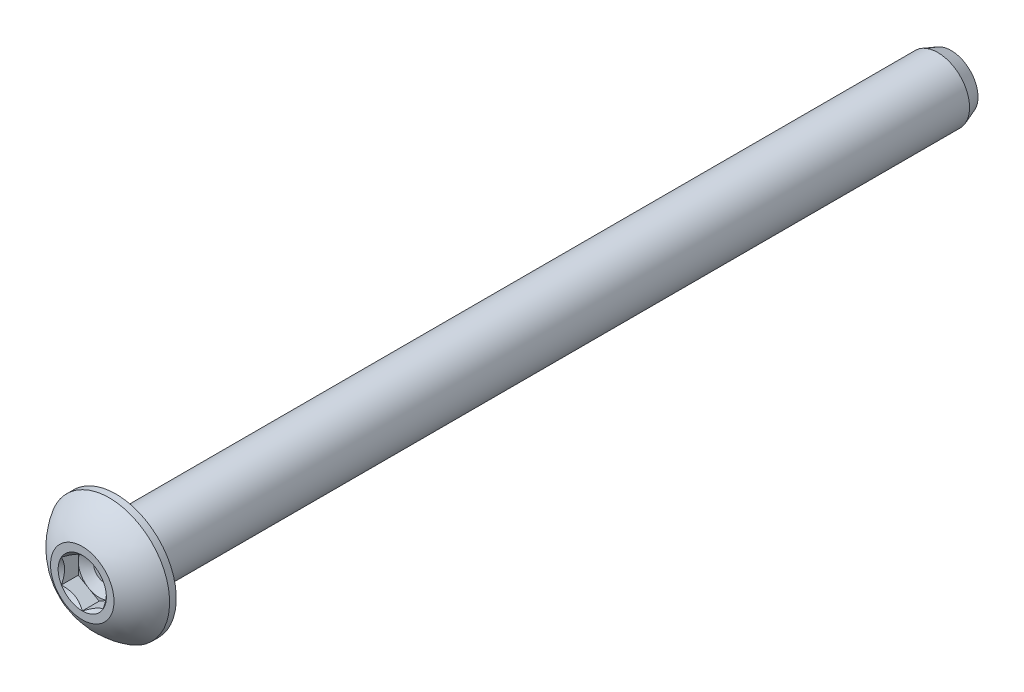
ISO-10303-21;
HEADER;
FILE_DESCRIPTION(('STEP AP214'),'2;1');
FILE_NAME('part.step','',(''),(''),'','','');
FILE_SCHEMA(('AUTOMOTIVE_DESIGN { 1 0 10303 214 1 1 1 1 }'));
ENDSEC;
DATA;
#1=APPLICATION_CONTEXT('core data for automotive mechanical design processes');
#2=APPLICATION_PROTOCOL_DEFINITION('international standard','automotive_design',2000,#1);
#3=PRODUCT_CONTEXT('',#1,'mechanical');
#4=PRODUCT('Part','Part','',(#3));
#5=PRODUCT_RELATED_PRODUCT_CATEGORY('part','',(#4));
#6=PRODUCT_DEFINITION_FORMATION('','',#4);
#7=PRODUCT_DEFINITION_CONTEXT('part definition',#1,'design');
#8=PRODUCT_DEFINITION('design','',#6,#7);
#9=PRODUCT_DEFINITION_SHAPE('','',#8);
#10=(LENGTH_UNIT() NAMED_UNIT(*) SI_UNIT(.MILLI.,.METRE.));
#11=(NAMED_UNIT(*) PLANE_ANGLE_UNIT() SI_UNIT($,.RADIAN.));
#12=(NAMED_UNIT(*) SI_UNIT($,.STERADIAN.) SOLID_ANGLE_UNIT());
#13=UNCERTAINTY_MEASURE_WITH_UNIT(LENGTH_MEASURE(1.E-05),#10,'distance_accuracy_value','');
#14=(GEOMETRIC_REPRESENTATION_CONTEXT(3) GLOBAL_UNCERTAINTY_ASSIGNED_CONTEXT((#13)) GLOBAL_UNIT_ASSIGNED_CONTEXT((#10,
#11,#12)) REPRESENTATION_CONTEXT('',''));
#15=CARTESIAN_POINT('',(0.,0.,0.));
#16=DIRECTION('',(0.,0.,1.));
#17=DIRECTION('',(1.,0.,0.));
#18=AXIS2_PLACEMENT_3D('',#15,#16,#17);
#19=CARTESIAN_POINT('',(0.,0.,0.855133333333334));
#20=DIRECTION('',(0.,0.,1.));
#21=DIRECTION('',(1.,0.,0.));
#22=AXIS2_PLACEMENT_3D('',#19,#20,#21);
#23=PLANE('',#22);
#24=CARTESIAN_POINT('',(0.,0.,0.855133333330517));
#25=DIRECTION('',(0.,0.,1.));
#26=DIRECTION('',(1.,0.,0.));
#27=AXIS2_PLACEMENT_3D('',#24,#25,#26);
#28=CIRCLE('',#27,0.846932809736245);
#29=CARTESIAN_POINT('',(0.846932809736245,0.,0.855133333330517));
#30=VERTEX_POINT('',#29);
#31=EDGE_CURVE('E21',#30,#30,#28,.T.);
#32=ORIENTED_EDGE('',*,*,#31,.T.);
#33=EDGE_LOOP('',(#32));
#34=FACE_BOUND('',#33,.T.);
#35=ADVANCED_FACE('F18',(#34),#23,.T.);
#36=CARTESIAN_POINT('',(0.,0.,1.28269999987651));
#37=DIRECTION('',(0.,0.,1.));
#38=DIRECTION('',(1.,0.,0.));
#39=AXIS2_PLACEMENT_3D('',#36,#37,#38);
#40=CONICAL_SURFACE('',#39,1.58749999980046,1.04719755118706);
#41=ORIENTED_EDGE('',*,*,#31,.F.);
#42=EDGE_LOOP('',(#41));
#43=FACE_BOUND('',#42,.T.);
#44=CARTESIAN_POINT('',(0.,0.,1.28270000000779));
#45=DIRECTION('',(0.,0.,1.));
#46=DIRECTION('',(1.,0.,0.));
#47=AXIS2_PLACEMENT_3D('',#44,#45,#46);
#48=CIRCLE('',#47,1.58750000002783);
#49=CARTESIAN_POINT('',(0.793750000006951,-1.37481532851988,1.28270000000389));
#50=VERTEX_POINT('',#49);
#51=CARTESIAN_POINT('',(1.58750000001387,0.,1.28270000000389));
#52=VERTEX_POINT('',#51);
#53=EDGE_CURVE('E77',#50,#52,#48,.T.);
#54=ORIENTED_EDGE('',*,*,#53,.T.);
#55=CARTESIAN_POINT('',(0.,0.,1.28270000000779));
#56=DIRECTION('',(0.,0.,1.));
#57=DIRECTION('',(1.,0.,0.));
#58=AXIS2_PLACEMENT_3D('',#55,#56,#57);
#59=CIRCLE('',#58,1.58750000002783);
#60=CARTESIAN_POINT('',(0.793750000006925,1.37481532851983,1.28270000000389));
#61=VERTEX_POINT('',#60);
#62=EDGE_CURVE('E81',#52,#61,#59,.T.);
#63=ORIENTED_EDGE('',*,*,#62,.T.);
#64=CARTESIAN_POINT('',(0.,0.,1.28270000000779));
#65=DIRECTION('',(0.,0.,1.));
#66=DIRECTION('',(1.,0.,0.));
#67=AXIS2_PLACEMENT_3D('',#64,#65,#66);
#68=CIRCLE('',#67,1.58750000002783);
#69=CARTESIAN_POINT('',(-0.793750000007028,1.37481532851979,1.28270000000389));
#70=VERTEX_POINT('',#69);
#71=EDGE_CURVE('E85',#61,#70,#68,.T.);
#72=ORIENTED_EDGE('',*,*,#71,.T.);
#73=CARTESIAN_POINT('',(0.,0.,1.28270000000779));
#74=DIRECTION('',(0.,0.,1.));
#75=DIRECTION('',(1.,0.,0.));
#76=AXIS2_PLACEMENT_3D('',#73,#74,#75);
#77=CIRCLE('',#76,1.58750000002783);
#78=CARTESIAN_POINT('',(-1.58750000001387,0.,1.28270000000389));
#79=VERTEX_POINT('',#78);
#80=EDGE_CURVE('E98',#70,#79,#77,.T.);
#81=ORIENTED_EDGE('',*,*,#80,.T.);
#82=CARTESIAN_POINT('',(0.,0.,1.28270000000779));
#83=DIRECTION('',(0.,0.,1.));
#84=DIRECTION('',(1.,0.,0.));
#85=AXIS2_PLACEMENT_3D('',#82,#83,#84);
#86=CIRCLE('',#85,1.58750000002783);
#87=CARTESIAN_POINT('',(-0.793750000006951,-1.37481532851986,1.28270000000389));
#88=VERTEX_POINT('',#87);
#89=EDGE_CURVE('E107',#79,#88,#86,.T.);
#90=ORIENTED_EDGE('',*,*,#89,.T.);
#91=CARTESIAN_POINT('',(0.,0.,1.28270000000779));
#92=DIRECTION('',(0.,0.,1.));
#93=DIRECTION('',(1.,0.,0.));
#94=AXIS2_PLACEMENT_3D('',#91,#92,#93);
#95=CIRCLE('',#94,1.58750000002783);
#96=EDGE_CURVE('E408',#88,#50,#95,.T.);
#97=ORIENTED_EDGE('',*,*,#96,.T.);
#98=EDGE_LOOP('',(#54,#63,#72,#81,#90,#97));
#99=FACE_BOUND('',#98,.T.);
#100=ADVANCED_FACE('F83',(#43,#99),#40,.F.);
#101=CARTESIAN_POINT('',(-1.58750000000002,-0.916543552338542,1.2827));
#102=DIRECTION('',(0.,0.,-1.));
#103=DIRECTION('',(-1.,0.,0.));
#104=AXIS2_PLACEMENT_3D('',#101,#102,#103);
#105=PLANE('',#104);
#106=DIRECTION('',(0.,1.,0.));
#107=VECTOR('',#106,1.);
#108=CARTESIAN_POINT('',(1.58749999999991,-0.916543552338528,1.2827));
#109=LINE('',#108,#107);
#110=CARTESIAN_POINT('',(1.58749999999991,0.916543552338514,1.2827));
#111=VERTEX_POINT('',#110);
#112=EDGE_CURVE('E92',#52,#111,#109,.T.);
#113=ORIENTED_EDGE('',*,*,#112,.T.);
#114=DIRECTION('',(-0.866025403784439,0.5,0.));
#115=VECTOR('',#114,1.);
#116=CARTESIAN_POINT('',(1.58749999999991,0.916543552338514,1.2827));
#117=LINE('',#116,#115);
#118=EDGE_CURVE('E90',#111,#61,#117,.T.);
#119=ORIENTED_EDGE('',*,*,#118,.T.);
#120=ORIENTED_EDGE('',*,*,#62,.F.);
#121=EDGE_LOOP('',(#113,#119,#120));
#122=FACE_BOUND('',#121,.T.);
#123=ADVANCED_FACE('F91',(#122),#105,.F.);
#124=CARTESIAN_POINT('',(-1.58750000000002,-0.916543552338542,1.2827));
#125=DIRECTION('',(0.,0.,-1.));
#126=DIRECTION('',(-1.,0.,0.));
#127=AXIS2_PLACEMENT_3D('',#124,#125,#126);
#128=PLANE('',#127);
#129=DIRECTION('',(0.866025403784439,0.5,0.));
#130=VECTOR('',#129,1.);
#131=CARTESIAN_POINT('',(0.,-1.83308710467708,1.2827));
#132=LINE('',#131,#130);
#133=CARTESIAN_POINT('',(1.58749999999994,-0.91654355233861,1.2827));
#134=VERTEX_POINT('',#133);
#135=EDGE_CURVE('E151',#50,#134,#132,.T.);
#136=ORIENTED_EDGE('',*,*,#135,.T.);
#137=DIRECTION('',(0.,1.,0.));
#138=VECTOR('',#137,1.);
#139=CARTESIAN_POINT('',(1.58749999999991,-0.916543552338528,1.2827));
#140=LINE('',#139,#138);
#141=EDGE_CURVE('E112',#134,#52,#140,.T.);
#142=ORIENTED_EDGE('',*,*,#141,.T.);
#143=ORIENTED_EDGE('',*,*,#53,.F.);
#144=EDGE_LOOP('',(#136,#142,#143));
#145=FACE_BOUND('',#144,.T.);
#146=ADVANCED_FACE('F296',(#145),#128,.F.);
#147=CARTESIAN_POINT('',(-1.58750000000002,-0.916543552338542,1.2827));
#148=DIRECTION('',(0.,0.,-1.));
#149=DIRECTION('',(-1.,0.,0.));
#150=AXIS2_PLACEMENT_3D('',#147,#148,#149);
#151=PLANE('',#150);
#152=DIRECTION('',(0.866025403784439,-0.5,0.));
#153=VECTOR('',#152,1.);
#154=CARTESIAN_POINT('',(-1.58750000000002,-0.916543552338542,1.2827));
#155=LINE('',#154,#153);
#156=CARTESIAN_POINT('',(0.,-1.8330871046771,1.2827));
#157=VERTEX_POINT('',#156);
#158=EDGE_CURVE('E140',#88,#157,#155,.T.);
#159=ORIENTED_EDGE('',*,*,#158,.T.);
#160=DIRECTION('',(0.866025403784439,0.5,0.));
#161=VECTOR('',#160,1.);
#162=CARTESIAN_POINT('',(0.,-1.83308710467708,1.2827));
#163=LINE('',#162,#161);
#164=EDGE_CURVE('E148',#157,#50,#163,.T.);
#165=ORIENTED_EDGE('',*,*,#164,.T.);
#166=ORIENTED_EDGE('',*,*,#96,.F.);
#167=EDGE_LOOP('',(#159,#165,#166));
#168=FACE_BOUND('',#167,.T.);
#169=ADVANCED_FACE('F292',(#168),#151,.F.);
#170=CARTESIAN_POINT('',(-1.58750000000002,-0.916543552338542,1.2827));
#171=DIRECTION('',(0.,0.,-1.));
#172=DIRECTION('',(-1.,0.,0.));
#173=AXIS2_PLACEMENT_3D('',#170,#171,#172);
#174=PLANE('',#173);
#175=DIRECTION('',(0.,-1.,0.));
#176=VECTOR('',#175,1.);
#177=CARTESIAN_POINT('',(-1.58749999999991,0.9165435523385,1.2827));
#178=LINE('',#177,#176);
#179=CARTESIAN_POINT('',(-1.58749999999992,-0.916543552338558,1.2827));
#180=VERTEX_POINT('',#179);
#181=EDGE_CURVE('E129',#79,#180,#178,.T.);
#182=ORIENTED_EDGE('',*,*,#181,.T.);
#183=DIRECTION('',(0.866025403784439,-0.5,0.));
#184=VECTOR('',#183,1.);
#185=CARTESIAN_POINT('',(-1.58750000000002,-0.916543552338542,1.2827));
#186=LINE('',#185,#184);
#187=EDGE_CURVE('E137',#180,#88,#186,.T.);
#188=ORIENTED_EDGE('',*,*,#187,.T.);
#189=ORIENTED_EDGE('',*,*,#89,.F.);
#190=EDGE_LOOP('',(#182,#188,#189));
#191=FACE_BOUND('',#190,.T.);
#192=ADVANCED_FACE('F289',(#191),#174,.F.);
#193=CARTESIAN_POINT('',(-1.58750000000002,-0.916543552338542,1.2827));
#194=DIRECTION('',(0.,0.,-1.));
#195=DIRECTION('',(-1.,0.,0.));
#196=AXIS2_PLACEMENT_3D('',#193,#194,#195);
#197=PLANE('',#196);
#198=DIRECTION('',(-0.866025403784439,0.5,0.));
#199=VECTOR('',#198,1.);
#200=CARTESIAN_POINT('',(1.58749999999991,0.916543552338514,1.2827));
#201=LINE('',#200,#199);
#202=CARTESIAN_POINT('',(0.,1.83308710467702,1.2827));
#203=VERTEX_POINT('',#202);
#204=EDGE_CURVE('E97',#61,#203,#201,.T.);
#205=ORIENTED_EDGE('',*,*,#204,.T.);
#206=DIRECTION('',(-0.866025403784439,-0.5,0.));
#207=VECTOR('',#206,1.);
#208=CARTESIAN_POINT('',(0.,1.83308710467703,1.2827));
#209=LINE('',#208,#207);
#210=EDGE_CURVE('E105',#203,#70,#209,.T.);
#211=ORIENTED_EDGE('',*,*,#210,.T.);
#212=ORIENTED_EDGE('',*,*,#71,.F.);
#213=EDGE_LOOP('',(#205,#211,#212));
#214=FACE_BOUND('',#213,.T.);
#215=ADVANCED_FACE('F102',(#214),#197,.F.);
#216=CARTESIAN_POINT('',(-1.58750000000002,-0.916543552338542,1.2827));
#217=DIRECTION('',(0.,0.,-1.));
#218=DIRECTION('',(-1.,0.,0.));
#219=AXIS2_PLACEMENT_3D('',#216,#217,#218);
#220=PLANE('',#219);
#221=DIRECTION('',(-0.866025403784439,-0.5,0.));
#222=VECTOR('',#221,1.);
#223=CARTESIAN_POINT('',(0.,1.83308710467703,1.2827));
#224=LINE('',#223,#222);
#225=CARTESIAN_POINT('',(-1.58749999999992,0.916543552338538,1.2827));
#226=VERTEX_POINT('',#225);
#227=EDGE_CURVE('E122',#70,#226,#224,.T.);
#228=ORIENTED_EDGE('',*,*,#227,.T.);
#229=DIRECTION('',(0.,-1.,0.));
#230=VECTOR('',#229,1.);
#231=CARTESIAN_POINT('',(-1.58749999999991,0.9165435523385,1.2827));
#232=LINE('',#231,#230);
#233=EDGE_CURVE('E126',#226,#79,#232,.T.);
#234=ORIENTED_EDGE('',*,*,#233,.T.);
#235=ORIENTED_EDGE('',*,*,#80,.F.);
#236=EDGE_LOOP('',(#228,#234,#235));
#237=FACE_BOUND('',#236,.T.);
#238=ADVANCED_FACE('F283',(#237),#220,.F.);
#239=CARTESIAN_POINT('',(1.58749999999991,0.916543552338514,1.2827));
#240=DIRECTION('',(0.5,0.866025403784439,0.));
#241=DIRECTION('',(-0.866025403784439,0.5,0.));
#242=AXIS2_PLACEMENT_3D('',#239,#240,#241);
#243=PLANE('',#242);
#244=CARTESIAN_POINT('',(1.58750000001185,0.91654355233162,2.56539999993598));
#245=CARTESIAN_POINT('',(1.53293684974874,0.948045601823858,2.53392818229203));
#246=CARTESIAN_POINT('',(1.4774614024377,0.980074366262304,2.50430506271237));
#247=CARTESIAN_POINT('',(1.36434127235532,1.04538430381613,2.45006639538277));
#248=CARTESIAN_POINT('',(1.30668583773197,1.07867168451617,2.42548101614827));
#249=CARTESIAN_POINT('',(1.19042648197841,1.1457940548563,2.3833660960344));
#250=CARTESIAN_POINT('',(1.13185215264058,1.1796119596671,2.36573072946296));
#251=CARTESIAN_POINT('',(1.01341433790047,1.24799206388953,2.3385600885892));
#252=CARTESIAN_POINT('',(0.953554468003095,1.28255217588843,2.3290045400331));
#253=CARTESIAN_POINT('',(0.850383225974686,1.34211812024616,2.32038274178906));
#254=CARTESIAN_POINT('',(0.807205047813984,1.36704705303036,2.31910682167378));
#255=CARTESIAN_POINT('',(0.720919334279943,1.41686413296646,2.32125913774122));
#256=CARTESIAN_POINT('',(0.677811828968887,1.44175226276189,2.32468902277264));
#257=CARTESIAN_POINT('',(0.592014800120523,1.49128720046317,2.33605631407201));
#258=CARTESIAN_POINT('',(0.549325670754726,1.51593378079398,2.34399762009834));
#259=CARTESIAN_POINT('',(0.46466394932955,1.56481324844886,2.36395627670772));
#260=CARTESIAN_POINT('',(0.422691672838002,1.58904595357976,2.37597537616383));
#261=CARTESIAN_POINT('',(0.315224720564427,1.65109202740389,2.41164383175777));
#262=CARTESIAN_POINT('',(0.250395444006949,1.68852122767572,2.43797770742184));
#263=CARTESIAN_POINT('',(0.155071115738203,1.743556754262,2.4824306144577));
#264=CARTESIAN_POINT('',(0.123658790094601,1.76169266892821,2.49804835918406));
#265=CARTESIAN_POINT('',(0.0614115175812596,1.79763114847011,2.53070945048178));
#266=CARTESIAN_POINT('',(0.0305763044283722,1.81543386708445,2.54775211869481));
#267=CARTESIAN_POINT('',(-1.19450151287092E-11,1.83308710468389,2.565399999936));
#268=B_SPLINE_CURVE_WITH_KNOTS('',3,(#244,#245,#246,#247,#248,#249,#250,#251,#252,#253,#254,
#255,#256,#257,#258,#259,#260,#261,#262,#263,#264,#265,#266,#267),.UNSPECIFIED.,.F.,.F.,(4,2,2,
2,2,2,2,2,2,2,2,4),(0.,0.21142792770008,0.42408719708428,0.633370156328154,0.842126401391114,
0.991537200929581,1.1410003653069,1.29059292551435,1.4402497238465,1.6778172140346,
1.79627069405981,1.9146680999862),.UNSPECIFIED.);
#269=CARTESIAN_POINT('',(1.58750000000588,0.916543552341969,2.56539999993598));
#270=VERTEX_POINT('',#269);
#271=CARTESIAN_POINT('',(1.1273531229641E-12,1.83308710467768,2.56539999992979));
#272=VERTEX_POINT('',#271);
#273=EDGE_CURVE('E270',#270,#272,#268,.T.);
#274=ORIENTED_EDGE('',*,*,#273,.T.);
#275=DIRECTION('',(0.,0.,1.));
#276=VECTOR('',#275,1.);
#277=CARTESIAN_POINT('',(0.,1.83308710467703,1.2827));
#278=LINE('',#277,#276);
#279=EDGE_CURVE('E111',#272,#203,#278,.F.);
#280=ORIENTED_EDGE('',*,*,#279,.T.);
#281=ORIENTED_EDGE('',*,*,#204,.F.);
#282=ORIENTED_EDGE('',*,*,#118,.F.);
#283=DIRECTION('',(0.,0.,1.));
#284=VECTOR('',#283,1.);
#285=CARTESIAN_POINT('',(1.58749999999991,0.916543552338514,1.2827));
#286=LINE('',#285,#284);
#287=EDGE_CURVE('E152',#111,#270,#286,.T.);
#288=ORIENTED_EDGE('',*,*,#287,.T.);
#289=EDGE_LOOP('',(#274,#280,#281,#282,#288));
#290=FACE_BOUND('',#289,.T.);
#291=ADVANCED_FACE('F109',(#290),#243,.F.);
#292=CARTESIAN_POINT('',(1.58749999999991,-0.916543552338528,1.2827));
#293=DIRECTION('',(1.,0.,0.));
#294=DIRECTION('',(0.,1.,0.));
#295=AXIS2_PLACEMENT_3D('',#292,#293,#294);
#296=PLANE('',#295);
#297=CARTESIAN_POINT('',(1.58749999999991,-0.916543552352334,2.56539999993599));
#298=CARTESIAN_POINT('',(1.58749999999991,-0.853951042751045,2.53413294687157));
#299=CARTESIAN_POINT('',(1.58749999999991,-0.790318655183798,2.50469158144839));
#300=CARTESIAN_POINT('',(1.58749999999991,-0.660541633658649,2.45072496397082));
#301=CARTESIAN_POINT('',(1.58749999999991,-0.594383506069397,2.42623244845365));
#302=CARTESIAN_POINT('',(1.58749999999991,-0.460155167710919,2.38393913822341));
#303=CARTESIAN_POINT('',(1.58749999999991,-0.39209228736965,2.36611569660129));
#304=CARTESIAN_POINT('',(1.58749999999991,-0.254474472998901,2.33867573772197));
#305=CARTESIAN_POINT('',(1.58749999999991,-0.184924844085367,2.3290338417733));
#306=CARTESIAN_POINT('',(1.58749999999991,-0.0959348173029596,2.32259288204429));
#307=CARTESIAN_POINT('',(1.58749999999991,-0.0767574755190686,2.32155158039191));
#308=CARTESIAN_POINT('',(1.58749999999991,-0.0383876515906479,2.32016146096761));
#309=CARTESIAN_POINT('',(1.58749999999991,-0.0191951833459973,2.31981226701814));
#310=CARTESIAN_POINT('',(1.58749999999991,0.0481761373886669,2.31981447199555));
#311=CARTESIAN_POINT('',(1.58749999999991,0.0963693775084981,2.32201961832725));
#312=CARTESIAN_POINT('',(1.58749999999991,0.192379976759667,2.33070924092623));
#313=CARTESIAN_POINT('',(1.58749999999991,0.240197050167158,2.3371967019236));
#314=CARTESIAN_POINT('',(1.58749999999991,0.383011002180353,2.3626769834978));
#315=CARTESIAN_POINT('',(1.58749999999991,0.476967063071624,2.38768338081251));
#316=CARTESIAN_POINT('',(1.58749999999991,0.62873718987545,2.43884002865904));
#317=CARTESIAN_POINT('',(1.58749999999991,0.687787687831556,2.46158766207784));
#318=CARTESIAN_POINT('',(1.58749999999991,0.803652764121719,2.51088912315494));
#319=CARTESIAN_POINT('',(1.58749999999991,0.860482853238123,2.53740623436211));
#320=CARTESIAN_POINT('',(1.58749999999991,0.916543552352318,2.56539999993598));
#321=B_SPLINE_CURVE_WITH_KNOTS('',3,(#297,#298,#299,#300,#301,#302,#303,#304,#305,#306,#307,
#308,#309,#310,#311,#312,#313,#314,#315,#316,#317,#318,#319,#320),.UNSPECIFIED.,.F.,.F.,(4,2,2,
2,2,2,2,2,2,2,2,4),(0.,0.210047204138947,0.421441388616464,0.632111059444868,0.842124830789351,
0.899732953408524,0.957309756000625,1.10181621379675,1.24642349763582,1.53683268063598,
1.72655304070381,1.91453812064542),.UNSPECIFIED.);
#322=CARTESIAN_POINT('',(1.58750000000589,-0.916543552342033,2.56539999993602));
#323=VERTEX_POINT('',#322);
#324=EDGE_CURVE('E265',#323,#270,#321,.T.);
#325=ORIENTED_EDGE('',*,*,#324,.T.);
#326=ORIENTED_EDGE('',*,*,#287,.F.);
#327=ORIENTED_EDGE('',*,*,#112,.F.);
#328=ORIENTED_EDGE('',*,*,#141,.F.);
#329=DIRECTION('',(0.,0.,1.));
#330=VECTOR('',#329,1.);
#331=CARTESIAN_POINT('',(1.58749999999996,-0.91654355233861,1.2827));
#332=LINE('',#331,#330);
#333=EDGE_CURVE('E141',#134,#323,#332,.T.);
#334=ORIENTED_EDGE('',*,*,#333,.T.);
#335=EDGE_LOOP('',(#325,#326,#327,#328,#334));
#336=FACE_BOUND('',#335,.T.);
#337=ADVANCED_FACE('F276',(#336),#296,.F.);
#338=CARTESIAN_POINT('',(0.,-1.83308710467708,1.2827));
#339=DIRECTION('',(0.5,-0.866025403784439,0.));
#340=DIRECTION('',(0.866025403784439,0.5,0.));
#341=AXIS2_PLACEMENT_3D('',#338,#339,#340);
#342=PLANE('',#341);
#343=CARTESIAN_POINT('',(-1.18407458458331E-11,-1.83308710468395,2.56539999993606));
#344=CARTESIAN_POINT('',(0.0545631502512638,-1.80158505519171,2.53392818229212));
#345=CARTESIAN_POINT('',(0.110038597562308,-1.76955629075327,2.50430506271246));
#346=CARTESIAN_POINT('',(0.223158727644685,-1.70424635319944,2.45006639538286));
#347=CARTESIAN_POINT('',(0.280814162268038,-1.6709589724994,2.42548101614836));
#348=CARTESIAN_POINT('',(0.397073518021597,-1.60383660215928,2.3833660960345));
#349=CARTESIAN_POINT('',(0.455647847359426,-1.57001869734848,2.36573072946306));
#350=CARTESIAN_POINT('',(0.574085662099533,-1.50163859312605,2.3385600885893));
#351=CARTESIAN_POINT('',(0.633945531996905,-1.46707848112714,2.32900454003321));
#352=CARTESIAN_POINT('',(0.737116774025315,-1.40751253676941,2.32038274178917));
#353=CARTESIAN_POINT('',(0.78029495218602,-1.38258360398521,2.31910682167389));
#354=CARTESIAN_POINT('',(0.866580665720066,-1.33276652404911,2.32125913774133));
#355=CARTESIAN_POINT('',(0.909688171031124,-1.30787839425368,2.32468902277275));
#356=CARTESIAN_POINT('',(0.995485199879494,-1.2583434565524,2.33605631407212));
#357=CARTESIAN_POINT('',(1.03817432924529,-1.23369687622159,2.34399762009845));
#358=CARTESIAN_POINT('',(1.12283605067047,-1.1848174085667,2.36395627670783));
#359=CARTESIAN_POINT('',(1.16480832716203,-1.1605847034358,2.37597537616395));
#360=CARTESIAN_POINT('',(1.27227527943558,-1.09853862961168,2.41164383175788));
#361=CARTESIAN_POINT('',(1.33710455599304,-1.06110942933986,2.43797770742194));
#362=CARTESIAN_POINT('',(1.43242888426176,-1.00607390275359,2.48243061445778));
#363=CARTESIAN_POINT('',(1.46384120990536,-0.98793798808739,2.49804835918414));
#364=CARTESIAN_POINT('',(1.52608848241868,-0.951999508545502,2.53070945048185));
#365=CARTESIAN_POINT('',(1.55692369557156,-0.934196789931168,2.54775211869488));
#366=CARTESIAN_POINT('',(1.58750000001187,-0.916543552331731,2.56539999993605));
#367=B_SPLINE_CURVE_WITH_KNOTS('',3,(#343,#344,#345,#346,#347,#348,#349,#350,#351,#352,#353,
#354,#355,#356,#357,#358,#359,#360,#361,#362,#363,#364,#365,#366),.UNSPECIFIED.,.F.,.F.,(4,2,2,
2,2,2,2,2,2,2,2,4),(0.,0.211427927700075,0.424087197084271,0.633370156328141,0.842126401391096,
0.991537200929572,1.1410003653069,1.29059292551436,1.44024972384652,1.67781721403455,
1.79627069405973,1.91466809998608),.UNSPECIFIED.);
#368=CARTESIAN_POINT('',(0.,-1.83308710468396,2.56539999993607));
#369=VERTEX_POINT('',#368);
#370=EDGE_CURVE('E247',#369,#323,#367,.T.);
#371=ORIENTED_EDGE('',*,*,#370,.T.);
#372=ORIENTED_EDGE('',*,*,#333,.F.);
#373=ORIENTED_EDGE('',*,*,#135,.F.);
#374=ORIENTED_EDGE('',*,*,#164,.F.);
#375=DIRECTION('',(0.,0.,1.));
#376=VECTOR('',#375,1.);
#377=CARTESIAN_POINT('',(0.,-1.83308710467711,1.2827));
#378=LINE('',#377,#376);
#379=EDGE_CURVE('E130',#157,#369,#378,.T.);
#380=ORIENTED_EDGE('',*,*,#379,.T.);
#381=EDGE_LOOP('',(#371,#372,#373,#374,#380));
#382=FACE_BOUND('',#381,.T.);
#383=ADVANCED_FACE('F237',(#382),#342,.F.);
#384=CARTESIAN_POINT('',(-1.58750000000002,-0.916543552338542,1.2827));
#385=DIRECTION('',(-0.5,-0.866025403784439,0.));
#386=DIRECTION('',(0.866025403784439,-0.5,0.));
#387=AXIS2_PLACEMENT_3D('',#384,#385,#386);
#388=PLANE('',#387);
#389=CARTESIAN_POINT('',(-1.5875000000119,-0.916543552331684,2.56539999993605));
#390=CARTESIAN_POINT('',(-1.53293684974879,-0.948045601823922,2.53392818229211));
#391=CARTESIAN_POINT('',(-1.47746140243775,-0.980074366262369,2.50430506271244));
#392=CARTESIAN_POINT('',(-1.36434127235537,-1.0453843038162,2.45006639538284));
#393=CARTESIAN_POINT('',(-1.30668583773201,-1.07867168451624,2.42548101614834));
#394=CARTESIAN_POINT('',(-1.19042648197845,-1.14579405485637,2.38336609603448));
#395=CARTESIAN_POINT('',(-1.13185215264062,-1.17961195966717,2.36573072946304));
#396=CARTESIAN_POINT('',(-1.01341433790051,-1.2479920638896,2.33856008858927));
#397=CARTESIAN_POINT('',(-0.953554468003134,-1.2825521758885,2.32900454003318));
#398=CARTESIAN_POINT('',(-0.850383225974723,-1.34211812024624,2.32038274178914));
#399=CARTESIAN_POINT('',(-0.807205047814019,-1.36704705303044,2.31910682167386));
#400=CARTESIAN_POINT('',(-0.720919334279973,-1.41686413296654,2.3212591377413));
#401=CARTESIAN_POINT('',(-0.677811828968916,-1.44175226276197,2.32468902277272));
#402=CARTESIAN_POINT('',(-0.592014800120547,-1.49128720046324,2.33605631407209));
#403=CARTESIAN_POINT('',(-0.549325670754749,-1.51593378079406,2.34399762009842));
#404=CARTESIAN_POINT('',(-0.464663949329569,-1.56481324844894,2.36395627670781));
#405=CARTESIAN_POINT('',(-0.422691672838018,-1.58904595357984,2.37597537616392));
#406=CARTESIAN_POINT('',(-0.315224720564443,-1.65109202740398,2.41164383175786));
#407=CARTESIAN_POINT('',(-0.250395444006966,-1.68852122767581,2.43797770742192));
#408=CARTESIAN_POINT('',(-0.155071115738221,-1.74355675426209,2.48243061445778));
#409=CARTESIAN_POINT('',(-0.123658790094619,-1.76169266892829,2.49804835918414));
#410=CARTESIAN_POINT('',(-0.061411517581279,-1.79763114847019,2.53070945048187));
#411=CARTESIAN_POINT('',(-0.0305763044283919,-1.81543386708453,2.5477521186949));
#412=CARTESIAN_POINT('',(1.19249589899212E-11,-1.83308710468397,2.56539999993608));
#413=B_SPLINE_CURVE_WITH_KNOTS('',3,(#389,#390,#391,#392,#393,#394,#395,#396,#397,#398,#399,
#400,#401,#402,#403,#404,#405,#406,#407,#408,#409,#410,#411,#412),.UNSPECIFIED.,.F.,.F.,(4,2,2,
2,2,2,2,2,2,2,2,4),(0.,0.211427927700082,0.424087197084285,0.633370156328161,0.842126401391123,
0.991537200929596,1.14100036530692,1.29059292551438,1.44024972384654,1.67781721403463,
1.79627069405985,1.91466809998623),.UNSPECIFIED.);
#414=CARTESIAN_POINT('',(-1.5875000000059,-0.916543552341998,2.56539999993602));
#415=VERTEX_POINT('',#414);
#416=EDGE_CURVE('E241',#415,#369,#413,.T.);
#417=ORIENTED_EDGE('',*,*,#416,.T.);
#418=ORIENTED_EDGE('',*,*,#379,.F.);
#419=ORIENTED_EDGE('',*,*,#158,.F.);
#420=ORIENTED_EDGE('',*,*,#187,.F.);
#421=DIRECTION('',(0.,0.,1.));
#422=VECTOR('',#421,1.);
#423=CARTESIAN_POINT('',(-1.58749999999991,-0.916543552338542,1.2827));
#424=LINE('',#423,#422);
#425=EDGE_CURVE('E123',#180,#415,#424,.T.);
#426=ORIENTED_EDGE('',*,*,#425,.T.);
#427=EDGE_LOOP('',(#417,#418,#419,#420,#426));
#428=FACE_BOUND('',#427,.T.);
#429=ADVANCED_FACE('F233',(#428),#388,.F.);
#430=CARTESIAN_POINT('',(-1.58749999999991,0.9165435523385,1.2827));
#431=DIRECTION('',(-1.,0.,0.));
#432=DIRECTION('',(0.,-1.,0.));
#433=AXIS2_PLACEMENT_3D('',#430,#431,#432);
#434=PLANE('',#433);
#435=CARTESIAN_POINT('',(-1.58749999999991,0.916543552352306,2.56539999993598));
#436=CARTESIAN_POINT('',(-1.58749999999991,0.853539453367827,2.53392818229203));
#437=CARTESIAN_POINT('',(-1.58749999999991,0.789481924490931,2.50430506271236));
#438=CARTESIAN_POINT('',(-1.58749999999991,0.658862049383271,2.45006639538275));
#439=CARTESIAN_POINT('',(-1.58749999999991,0.59228728798319,2.42548101614825));
#440=CARTESIAN_POINT('',(-1.58749999999991,0.458042547302922,2.38336609603438));
#441=CARTESIAN_POINT('',(-1.58749999999991,0.390406737681323,2.36573072946294));
#442=CARTESIAN_POINT('',(-1.58749999999991,0.253646529236449,2.33856008858917));
#443=CARTESIAN_POINT('',(-1.58749999999991,0.184526305238635,2.32900454003307));
#444=CARTESIAN_POINT('',(-1.58749999999991,0.0653944165231728,2.32038274178903));
#445=CARTESIAN_POINT('',(-1.58749999999991,0.0155365509547759,2.31910682167375));
#446=CARTESIAN_POINT('',(-1.58749999999991,-0.0840976089174182,2.32125913774119));
#447=CARTESIAN_POINT('',(-1.58749999999991,-0.13387386850828,2.32468902277261));
#448=CARTESIAN_POINT('',(-1.58749999999991,-0.232943743910825,2.33605631407198));
#449=CARTESIAN_POINT('',(-1.58749999999991,-0.282236904572451,2.3439976200983));
#450=CARTESIAN_POINT('',(-1.58749999999991,-0.379995839882215,2.36395627670769));
#451=CARTESIAN_POINT('',(-1.58749999999991,-0.428461250144008,2.3759753761638));
#452=CARTESIAN_POINT('',(-1.58749999999991,-0.552553397792289,2.41164383175774));
#453=CARTESIAN_POINT('',(-1.58749999999991,-0.627411798335954,2.43797770742181));
#454=CARTESIAN_POINT('',(-1.58749999999991,-0.737482851508527,2.48243061445767));
#455=CARTESIAN_POINT('',(-1.58749999999991,-0.773754680840943,2.49804835918403));
#456=CARTESIAN_POINT('',(-1.58749999999991,-0.845631639924744,2.53070945048177));
#457=CARTESIAN_POINT('',(-1.58749999999991,-0.881237077153426,2.5477521186948));
#458=CARTESIAN_POINT('',(-1.58749999999991,-0.916543552352311,2.56539999993598));
#459=B_SPLINE_CURVE_WITH_KNOTS('',3,(#435,#436,#437,#438,#439,#440,#441,#442,#443,#444,#445,
#446,#447,#448,#449,#450,#451,#452,#453,#454,#455,#456,#457,#458),.UNSPECIFIED.,.F.,.F.,(4,2,2,
2,2,2,2,2,2,2,2,4),(0.,0.211427927700093,0.424087197084307,0.633370156328194,0.842126401391167,
0.991537200929631,1.14100036530695,1.29059292551439,1.44024972384654,1.67781721403467,
1.79627069405989,1.91466809998629),.UNSPECIFIED.);
#460=CARTESIAN_POINT('',(-1.58750000000589,0.916543552341976,2.56539999993599));
#461=VERTEX_POINT('',#460);
#462=EDGE_CURVE('E214',#461,#415,#459,.T.);
#463=ORIENTED_EDGE('',*,*,#462,.T.);
#464=ORIENTED_EDGE('',*,*,#425,.F.);
#465=ORIENTED_EDGE('',*,*,#181,.F.);
#466=ORIENTED_EDGE('',*,*,#233,.F.);
#467=DIRECTION('',(0.,0.,1.));
#468=VECTOR('',#467,1.);
#469=CARTESIAN_POINT('',(-1.58749999999993,0.916543552338538,1.2827));
#470=LINE('',#469,#468);
#471=EDGE_CURVE('E36',#226,#461,#470,.T.);
#472=ORIENTED_EDGE('',*,*,#471,.T.);
#473=EDGE_LOOP('',(#463,#464,#465,#466,#472));
#474=FACE_BOUND('',#473,.T.);
#475=ADVANCED_FACE('F226',(#474),#434,.F.);
#476=CARTESIAN_POINT('',(0.,1.83308710467703,1.2827));
#477=DIRECTION('',(-0.5,0.866025403784439,0.));
#478=DIRECTION('',(-0.866025403784439,-0.5,0.));
#479=AXIS2_PLACEMENT_3D('',#476,#477,#478);
#480=PLANE('',#479);
#481=CARTESIAN_POINT('',(1.19176626264607E-11,1.83308710468391,2.56539999993602));
#482=CARTESIAN_POINT('',(-0.0545631502511889,1.80158505519167,2.53392818229207));
#483=CARTESIAN_POINT('',(-0.110038597562235,1.76955629075322,2.50430506271241));
#484=CARTESIAN_POINT('',(-0.223158727644617,1.70424635319939,2.4500663953828));
#485=CARTESIAN_POINT('',(-0.280814162267972,1.67095897249935,2.4254810161483));
#486=CARTESIAN_POINT('',(-0.397073518021536,1.60383660215922,2.38336609603444));
#487=CARTESIAN_POINT('',(-0.455647847359367,1.57001869734842,2.365730729463));
#488=CARTESIAN_POINT('',(-0.57408566209948,1.50163859312599,2.33856008858923));
#489=CARTESIAN_POINT('',(-0.633945531996855,1.46707848112708,2.32900454003313));
#490=CARTESIAN_POINT('',(-0.737116774025266,1.40751253676935,2.32038274178909));
#491=CARTESIAN_POINT('',(-0.780294952185969,1.38258360398515,2.31910682167382));
#492=CARTESIAN_POINT('',(-0.866580665720012,1.33276652404905,2.32125913774125));
#493=CARTESIAN_POINT('',(-0.909688171031068,1.30787839425362,2.32468902277268));
#494=CARTESIAN_POINT('',(-0.995485199879435,1.25834345655235,2.33605631407204));
#495=CARTESIAN_POINT('',(-1.03817432924523,1.23369687622153,2.34399762009837));
#496=CARTESIAN_POINT('',(-1.12283605067041,1.18481740856665,2.36395627670775));
#497=CARTESIAN_POINT('',(-1.16480832716196,1.16058470343575,2.37597537616386));
#498=CARTESIAN_POINT('',(-1.27227527943553,1.09853862961162,2.4116438317578));
#499=CARTESIAN_POINT('',(-1.337104555993,1.0611094293398,2.43797770742187));
#500=CARTESIAN_POINT('',(-1.43242888426174,1.00607390275352,2.48243061445772));
#501=CARTESIAN_POINT('',(-1.46384120990533,0.987937988087316,2.49804835918408));
#502=CARTESIAN_POINT('',(-1.52608848241867,0.951999508545422,2.5307094504818));
#503=CARTESIAN_POINT('',(-1.55692369557155,0.934196789931085,2.54775211869483));
#504=CARTESIAN_POINT('',(-1.58750000001187,0.916543552331646,2.565399999936));
#505=B_SPLINE_CURVE_WITH_KNOTS('',3,(#481,#482,#483,#484,#485,#486,#487,#488,#489,#490,#491,
#492,#493,#494,#495,#496,#497,#498,#499,#500,#501,#502,#503,#504),.UNSPECIFIED.,.F.,.F.,(4,2,2,
2,2,2,2,2,2,2,2,4),(0.,0.211427927700086,0.424087197084293,0.633370156328173,0.842126401391139,
0.991537200929609,1.14100036530693,1.29059292551438,1.44024972384654,1.67781721403461,
1.79627069405981,1.91466809998618),.UNSPECIFIED.);
#506=EDGE_CURVE('E206',#272,#461,#505,.T.);
#507=ORIENTED_EDGE('',*,*,#506,.T.);
#508=ORIENTED_EDGE('',*,*,#471,.F.);
#509=ORIENTED_EDGE('',*,*,#227,.F.);
#510=ORIENTED_EDGE('',*,*,#210,.F.);
#511=ORIENTED_EDGE('',*,*,#279,.F.);
#512=EDGE_LOOP('',(#507,#508,#509,#510,#511));
#513=FACE_BOUND('',#512,.T.);
#514=ADVANCED_FACE('F221',(#513),#480,.F.);
#515=CARTESIAN_POINT('',(0.,0.,2.56539999986671));
#516=DIRECTION('',(0.,0.,1.));
#517=DIRECTION('',(1.,0.,0.));
#518=AXIS2_PLACEMENT_3D('',#515,#516,#517);
#519=CONICAL_SURFACE('',#518,1.83308710461461,0.785398163397448);
#520=ORIENTED_EDGE('',*,*,#273,.F.);
#521=CARTESIAN_POINT('',(0.,0.,2.56539999992356));
#522=DIRECTION('',(0.,0.,1.));
#523=DIRECTION('',(1.,0.,0.));
#524=AXIS2_PLACEMENT_3D('',#521,#522,#523);
#525=CIRCLE('',#524,1.83308710467145);
#526=EDGE_CURVE('E213',#272,#270,#525,.F.);
#527=ORIENTED_EDGE('',*,*,#526,.F.);
#528=EDGE_LOOP('',(#520,#527));
#529=FACE_BOUND('',#528,.T.);
#530=ADVANCED_FACE('F225',(#529),#519,.F.);
#531=CARTESIAN_POINT('',(0.,0.,2.56539999986671));
#532=DIRECTION('',(0.,0.,1.));
#533=DIRECTION('',(1.,0.,0.));
#534=AXIS2_PLACEMENT_3D('',#531,#532,#533);
#535=CONICAL_SURFACE('',#534,1.83308710461461,0.785398163397448);
#536=ORIENTED_EDGE('',*,*,#324,.F.);
#537=CARTESIAN_POINT('',(0.,0.,2.56539999992356));
#538=DIRECTION('',(0.,0.,1.));
#539=DIRECTION('',(1.,0.,0.));
#540=AXIS2_PLACEMENT_3D('',#537,#538,#539);
#541=CIRCLE('',#540,1.83308710467145);
#542=EDGE_CURVE('E364',#270,#323,#541,.F.);
#543=ORIENTED_EDGE('',*,*,#542,.F.);
#544=EDGE_LOOP('',(#536,#543));
#545=FACE_BOUND('',#544,.T.);
#546=ADVANCED_FACE('F260',(#545),#535,.F.);
#547=CARTESIAN_POINT('',(0.,0.,2.56539999986671));
#548=DIRECTION('',(0.,0.,1.));
#549=DIRECTION('',(1.,0.,0.));
#550=AXIS2_PLACEMENT_3D('',#547,#548,#549);
#551=CONICAL_SURFACE('',#550,1.83308710461461,0.785398163397448);
#552=ORIENTED_EDGE('',*,*,#370,.F.);
#553=CARTESIAN_POINT('',(0.,0.,2.56539999992356));
#554=DIRECTION('',(0.,0.,1.));
#555=DIRECTION('',(1.,0.,0.));
#556=AXIS2_PLACEMENT_3D('',#553,#554,#555);
#557=CIRCLE('',#556,1.83308710467145);
#558=EDGE_CURVE('E361',#323,#369,#557,.F.);
#559=ORIENTED_EDGE('',*,*,#558,.F.);
#560=EDGE_LOOP('',(#552,#559));
#561=FACE_BOUND('',#560,.T.);
#562=ADVANCED_FACE('F256',(#561),#551,.F.);
#563=CARTESIAN_POINT('',(0.,0.,2.56539999986671));
#564=DIRECTION('',(0.,0.,1.));
#565=DIRECTION('',(1.,0.,0.));
#566=AXIS2_PLACEMENT_3D('',#563,#564,#565);
#567=CONICAL_SURFACE('',#566,1.83308710461461,0.785398163397448);
#568=ORIENTED_EDGE('',*,*,#416,.F.);
#569=CARTESIAN_POINT('',(0.,0.,2.56539999992356));
#570=DIRECTION('',(0.,0.,1.));
#571=DIRECTION('',(1.,0.,0.));
#572=AXIS2_PLACEMENT_3D('',#569,#570,#571);
#573=CIRCLE('',#572,1.83308710467145);
#574=EDGE_CURVE('E358',#369,#415,#573,.F.);
#575=ORIENTED_EDGE('',*,*,#574,.F.);
#576=EDGE_LOOP('',(#568,#575));
#577=FACE_BOUND('',#576,.T.);
#578=ADVANCED_FACE('F253',(#577),#567,.F.);
#579=CARTESIAN_POINT('',(0.,0.,2.56539999986671));
#580=DIRECTION('',(0.,0.,1.));
#581=DIRECTION('',(1.,0.,0.));
#582=AXIS2_PLACEMENT_3D('',#579,#580,#581);
#583=CONICAL_SURFACE('',#582,1.83308710461461,0.785398163397448);
#584=ORIENTED_EDGE('',*,*,#462,.F.);
#585=CARTESIAN_POINT('',(0.,0.,2.56539999992356));
#586=DIRECTION('',(0.,0.,1.));
#587=DIRECTION('',(1.,0.,0.));
#588=AXIS2_PLACEMENT_3D('',#585,#586,#587);
#589=CIRCLE('',#588,1.83308710467145);
#590=EDGE_CURVE('E353',#415,#461,#589,.F.);
#591=ORIENTED_EDGE('',*,*,#590,.F.);
#592=EDGE_LOOP('',(#584,#591));
#593=FACE_BOUND('',#592,.T.);
#594=ADVANCED_FACE('F201',(#593),#583,.F.);
#595=CARTESIAN_POINT('',(0.,0.,2.56539999986671));
#596=DIRECTION('',(0.,0.,1.));
#597=DIRECTION('',(1.,0.,0.));
#598=AXIS2_PLACEMENT_3D('',#595,#596,#597);
#599=CONICAL_SURFACE('',#598,1.83308710461461,0.785398163397448);
#600=ORIENTED_EDGE('',*,*,#506,.F.);
#601=CARTESIAN_POINT('',(0.,0.,2.56539999992356));
#602=DIRECTION('',(0.,0.,1.));
#603=DIRECTION('',(1.,0.,0.));
#604=AXIS2_PLACEMENT_3D('',#601,#602,#603);
#605=CIRCLE('',#604,1.83308710467145);
#606=EDGE_CURVE('E186',#461,#272,#605,.F.);
#607=ORIENTED_EDGE('',*,*,#606,.F.);
#608=EDGE_LOOP('',(#600,#607));
#609=FACE_BOUND('',#608,.T.);
#610=ADVANCED_FACE('F196',(#609),#599,.F.);
#611=CARTESIAN_POINT('',(0.,0.,2.5654));
#612=DIRECTION('',(0.,0.,1.));
#613=DIRECTION('',(1.,0.,0.));
#614=AXIS2_PLACEMENT_3D('',#611,#612,#613);
#615=PLANE('',#614);
#616=CARTESIAN_POINT('',(0.,-2.413,2.5654));
#617=CARTESIAN_POINT('',(-0.0677494728281283,-2.41299959399954,2.5654));
#618=CARTESIAN_POINT('',(-0.135511396451976,-2.41014415989587,2.56540000000002));
#619=CARTESIAN_POINT('',(-0.270566967352963,-2.39874098782786,2.56539999999998));
#620=CARTESIAN_POINT('',(-0.337860470451792,-2.39019156931711,2.56539999999994));
#621=CARTESIAN_POINT('',(-0.471601320639759,-2.3674388925711,2.56540000000006));
#622=CARTESIAN_POINT('',(-0.538047150928333,-2.35322665951011,2.56540000000023));
#623=CARTESIAN_POINT('',(-0.669542290683503,-2.31924632100675,2.56539999999977));
#624=CARTESIAN_POINT('',(-0.73459042056199,-2.29947370693799,2.56539999999913));
#625=CARTESIAN_POINT('',(-0.926662950450373,-2.23208866037696,2.56539999999844));
#626=CARTESIAN_POINT('',(-1.05093873255642,-2.17635367452111,2.56539999999959));
#627=CARTESIAN_POINT('',(-1.2883554309699,-2.04478110377476,2.56540000000041));
#628=CARTESIAN_POINT('',(-1.40149592376956,-1.9689427546991,2.56540000000007));
#629=CARTESIAN_POINT('',(-1.56039704916755,-1.84183425468122,2.56539999999996));
#630=CARTESIAN_POINT('',(-1.61159242186085,-1.79720603297066,2.56539999999999));
#631=CARTESIAN_POINT('',(-1.71000632967646,-1.70383063464738,2.56540000000001));
#632=CARTESIAN_POINT('',(-1.75722865147865,-1.65508747081334,2.5654));
#633=CARTESIAN_POINT('',(-1.8474198337268,-1.5537729653388,2.5654));
#634=CARTESIAN_POINT('',(-1.89038675770035,-1.50119989956801,2.5654));
#635=CARTESIAN_POINT('',(-1.97174331906877,-1.39262581622356,2.5654));
#636=CARTESIAN_POINT('',(-2.01013189400737,-1.33662400751771,2.5654));
#637=CARTESIAN_POINT('',(-2.117976022643,-1.16408610688375,2.5654));
#638=CARTESIAN_POINT('',(-2.18020511880696,-1.04291047052778,2.5654));
#639=CARTESIAN_POINT('',(-2.28339851019845,-0.791897051410322,2.5654));
#640=CARTESIAN_POINT('',(-2.32436303254155,-0.662059361180337,2.5654));
#641=CARTESIAN_POINT('',(-2.38392374490441,-0.397332738666619,2.5654));
#642=CARTESIAN_POINT('',(-2.40251981546714,-0.262443779410933,2.5654));
#643=CARTESIAN_POINT('',(-2.41679648401004,0.00854142496431608,2.5654));
#644=CARTESIAN_POINT('',(-2.41247708199023,0.144637670083878,2.5654));
#645=CARTESIAN_POINT('',(-2.38106276220063,0.414157249403882,2.5654));
#646=CARTESIAN_POINT('',(-2.3539679660607,0.54758059787478,2.5654));
#647=CARTESIAN_POINT('',(-2.27772157192303,0.808047678299378,2.5654));
#648=CARTESIAN_POINT('',(-2.22856973834407,0.93509134209844,2.5654));
#649=CARTESIAN_POINT('',(-2.13945238372268,1.11800602259635,2.5654));
#650=CARTESIAN_POINT('',(-2.10716082445996,1.17773156541119,2.5654));
#651=CARTESIAN_POINT('',(-2.03766328061091,1.29425329321653,2.5654));
#652=CARTESIAN_POINT('',(-2.00045843572896,1.35105015331989,2.5654));
#653=CARTESIAN_POINT('',(-1.92141236423525,1.461280806753,2.5654));
#654=CARTESIAN_POINT('',(-1.87957324454215,1.51471611118975,2.5654));
#655=CARTESIAN_POINT('',(-1.79151575044593,1.6179156266782,2.5654));
#656=CARTESIAN_POINT('',(-1.74529318867504,1.6676762450584,2.5654));
#657=CARTESIAN_POINT('',(-1.6006279005699,1.8107779321448,2.5654));
#658=CARTESIAN_POINT('',(-1.49608260659496,1.89808490671828,2.5654));
#659=CARTESIAN_POINT('',(-1.27380547141754,2.05387612994838,2.5654));
#660=CARTESIAN_POINT('',(-1.15607413167658,2.12236109405876,2.5654));
#661=CARTESIAN_POINT('',(-0.972145513690383,2.20955550169803,2.5654));
#662=CARTESIAN_POINT('',(-0.909535130507359,2.2360537164585,2.5654));
#663=CARTESIAN_POINT('',(-0.782338486500657,2.28366305312173,2.5654));
#664=CARTESIAN_POINT('',(-0.717753872487776,2.30477853474403,2.5654));
#665=CARTESIAN_POINT('',(-0.587144181474085,2.34145833738058,2.5654));
#666=CARTESIAN_POINT('',(-0.521121555924419,2.35703142415597,2.5654));
#667=CARTESIAN_POINT('',(-0.388011850866889,2.38256269878371,2.5654));
#668=CARTESIAN_POINT('',(-0.320925091325894,2.39252254272931,2.5654));
#669=CARTESIAN_POINT('',(-0.211445294063846,2.40409104943932,2.5654));
#670=CARTESIAN_POINT('',(-0.169227541242235,2.40743084866624,2.5654));
#671=CARTESIAN_POINT('',(-0.0846748132034592,2.41188545081099,2.5654));
#672=CARTESIAN_POINT('',(-0.0423398379862939,2.41300025372882,2.5654));
#673=CARTESIAN_POINT('',(0.0677494728281283,2.41299959399954,2.5654));
#674=CARTESIAN_POINT('',(0.135511396451976,2.41014415989587,2.56540000000002));
#675=CARTESIAN_POINT('',(0.270566967352963,2.39874098782786,2.56539999999998));
#676=CARTESIAN_POINT('',(0.337860470451791,2.39019156931711,2.56539999999994));
#677=CARTESIAN_POINT('',(0.471601320639758,2.3674388925711,2.56540000000006));
#678=CARTESIAN_POINT('',(0.538047150928333,2.35322665951011,2.56540000000023));
#679=CARTESIAN_POINT('',(0.669542290683503,2.31924632100675,2.56539999999977));
#680=CARTESIAN_POINT('',(0.73459042056199,2.29947370693799,2.56539999999913));
#681=CARTESIAN_POINT('',(0.926662950450372,2.23208866037696,2.56539999999844));
#682=CARTESIAN_POINT('',(1.05093873255642,2.17635367452111,2.56539999999959));
#683=CARTESIAN_POINT('',(1.2883554309699,2.04478110377475,2.56540000000041));
#684=CARTESIAN_POINT('',(1.40149592376956,1.9689427546991,2.56540000000007));
#685=CARTESIAN_POINT('',(1.56039704916755,1.84183425468122,2.56539999999996));
#686=CARTESIAN_POINT('',(1.61159242186084,1.79720603297066,2.56539999999999));
#687=CARTESIAN_POINT('',(1.71000632967646,1.70383063464738,2.56540000000001));
#688=CARTESIAN_POINT('',(1.75722865147865,1.65508747081334,2.5654));
#689=CARTESIAN_POINT('',(1.8474198337268,1.5537729653388,2.5654));
#690=CARTESIAN_POINT('',(1.89038675770035,1.50119989956801,2.5654));
#691=CARTESIAN_POINT('',(1.97174331906877,1.39262581622356,2.5654));
#692=CARTESIAN_POINT('',(2.01013189400737,1.33662400751771,2.5654));
#693=CARTESIAN_POINT('',(2.117976022643,1.16408610688375,2.5654));
#694=CARTESIAN_POINT('',(2.18020511880696,1.04291047052778,2.5654));
#695=CARTESIAN_POINT('',(2.28339851019845,0.791897051410323,2.5654));
#696=CARTESIAN_POINT('',(2.32436303254155,0.662059361180339,2.5654));
#697=CARTESIAN_POINT('',(2.38392374490441,0.397332738666622,2.5654));
#698=CARTESIAN_POINT('',(2.40251981546714,0.262443779410935,2.5654));
#699=CARTESIAN_POINT('',(2.41679648401004,-0.00854142496431334,2.5654));
#700=CARTESIAN_POINT('',(2.41247708199023,-0.144637670083876,2.5654));
#701=CARTESIAN_POINT('',(2.38106276220063,-0.414157249403878,2.5654));
#702=CARTESIAN_POINT('',(2.3539679660607,-0.547580597874776,2.5654));
#703=CARTESIAN_POINT('',(2.27772157192303,-0.808047678299375,2.5654));
#704=CARTESIAN_POINT('',(2.22856973834407,-0.935091342098439,2.5654));
#705=CARTESIAN_POINT('',(2.13945238372268,-1.11800602259634,2.5654));
#706=CARTESIAN_POINT('',(2.10716082445996,-1.17773156541119,2.5654));
#707=CARTESIAN_POINT('',(2.03766328061091,-1.29425329321652,2.5654));
#708=CARTESIAN_POINT('',(2.00045843572896,-1.35105015331989,2.5654));
#709=CARTESIAN_POINT('',(1.92141236423526,-1.461280806753,2.5654));
#710=CARTESIAN_POINT('',(1.87957324454216,-1.51471611118975,2.5654));
#711=CARTESIAN_POINT('',(1.79151575044593,-1.61791562667819,2.5654));
#712=CARTESIAN_POINT('',(1.74529318867504,-1.6676762450584,2.5654));
#713=CARTESIAN_POINT('',(1.60062790056991,-1.8107779321448,2.5654));
#714=CARTESIAN_POINT('',(1.49608260659497,-1.89808490671828,2.5654));
#715=CARTESIAN_POINT('',(1.27380547141754,-2.05387612994838,2.5654));
#716=CARTESIAN_POINT('',(1.15607413167658,-2.12236109405876,2.5654));
#717=CARTESIAN_POINT('',(0.972145513690385,-2.20955550169803,2.5654));
#718=CARTESIAN_POINT('',(0.909535130507361,-2.2360537164585,2.5654));
#719=CARTESIAN_POINT('',(0.782338486500659,-2.28366305312173,2.5654));
#720=CARTESIAN_POINT('',(0.717753872487778,-2.30477853474403,2.5654));
#721=CARTESIAN_POINT('',(0.587144181474086,-2.34145833738058,2.5654));
#722=CARTESIAN_POINT('',(0.521121555924421,-2.35703142415597,2.5654));
#723=CARTESIAN_POINT('',(0.388011850866891,-2.38256269878371,2.5654));
#724=CARTESIAN_POINT('',(0.320925091325896,-2.39252254272931,2.5654));
#725=CARTESIAN_POINT('',(0.211445294063848,-2.40409104943933,2.5654));
#726=CARTESIAN_POINT('',(0.169227541242237,-2.40743084866624,2.5654));
#727=CARTESIAN_POINT('',(0.0846748132034601,-2.41188545081099,2.5654));
#728=CARTESIAN_POINT('',(0.0423398379862944,-2.41300025372882,2.5654));
#729=CARTESIAN_POINT('',(0.,-2.413,2.5654));
#730=B_SPLINE_CURVE_WITH_KNOTS('',3,(#616,#617,#618,#619,#620,#621,#622,#623,#624,#625,#626,
#627,#628,#629,#630,#631,#632,#633,#634,#635,#636,#637,#638,#639,#640,#641,#642,#643,#644,#645,
#646,#647,#648,#649,#650,#651,#652,#653,#654,#655,#656,#657,#658,#659,#660,#661,#662,#663,#664,
#665,#666,#667,#668,#669,#670,#671,#672,#673,#674,#675,#676,#677,#678,#679,#680,#681,#682,#683,
#684,#685,#686,#687,#688,#689,#690,#691,#692,#693,#694,#695,#696,#697,#698,#699,#700,#701,#702,
#703,#704,#705,#706,#707,#708,#709,#710,#711,#712,#713,#714,#715,#716,#717,#718,#719,#720,#721,
#722,#723,#724,#725,#726,#727,#728,#729),.UNSPECIFIED.,.T.,.F.,(4,2,2,2,2,2,2,2,2,2,2,2,2,2,2,2,
2,2,2,2,2,2,2,2,2,2,2,2,2,2,2,2,2,2,2,2,2,2,2,2,2,2,2,2,2,2,2,2,2,2,2,2,2,2,2,2,4),(0.,
0.203209440650578,0.406478883981526,0.610071772627371,0.813830222622106,1.22037583015364,
1.62693689383916,1.83048379912033,2.03383445452741,2.23727722607606,2.44076711727224,
2.8473226240272,3.25387378849007,3.66042712409905,4.06698045970799,4.4735316241708,
4.88008713092582,5.08357702212204,5.28701979367076,5.49037044907783,5.6939173543589,
6.10047841804411,6.50702402557577,6.7107824755709,6.914375364217,7.11764480754803,
7.32085424819875,7.44784940307259,7.57484455794645,7.77805399859703,7.98132344192798,
8.18491633057383,8.38867478056856,8.79522038810009,9.20178145178561,9.40532835706678,
9.60867901247387,9.81212178402251,10.0156116752187,10.4221671819736,10.8287183464365,
11.2352716820455,11.6418250176544,12.0483761821172,12.4549316888723,12.6584215800685,
12.8618643516172,13.0652150070243,13.2687619123053,13.6753229759906,14.0818685835222,
14.2856270335173,14.4892199221635,14.6924893654945,14.8956988061452,15.022693961019,
15.1496891158929),.UNSPECIFIED.);
#731=CARTESIAN_POINT('',(0.,-2.413,2.5654));
#732=VERTEX_POINT('',#731);
#733=EDGE_CURVE('E179',#732,#732,#730,.T.);
#734=ORIENTED_EDGE('',*,*,#733,.F.);
#735=EDGE_LOOP('',(#734));
#736=FACE_BOUND('',#735,.T.);
#737=ORIENTED_EDGE('',*,*,#590,.T.);
#738=ORIENTED_EDGE('',*,*,#606,.T.);
#739=ORIENTED_EDGE('',*,*,#526,.T.);
#740=ORIENTED_EDGE('',*,*,#542,.T.);
#741=ORIENTED_EDGE('',*,*,#558,.T.);
#742=ORIENTED_EDGE('',*,*,#574,.T.);
#743=EDGE_LOOP('',(#737,#738,#739,#740,#741,#742));
#744=FACE_BOUND('',#743,.T.);
#745=ADVANCED_FACE('F192',(#736,#744),#615,.T.);
#746=CARTESIAN_POINT('',(0.,0.,-2.15653055555556));
#747=DIRECTION('',(0.,1.,0.));
#748=DIRECTION('',(0.,0.,1.));
#749=AXIS2_PLACEMENT_3D('',#746,#747,#748);
#750=SPHERICAL_SURFACE('',#749,5.30275373475793);
#751=ORIENTED_EDGE('',*,*,#733,.T.);
#752=EDGE_LOOP('',(#751));
#753=FACE_BOUND('',#752,.T.);
#754=CARTESIAN_POINT('',(0.,0.,0.507999999999998));
#755=DIRECTION('',(0.,0.,-1.));
#756=DIRECTION('',(-1.,0.,0.));
#757=AXIS2_PLACEMENT_3D('',#754,#755,#756);
#758=CIRCLE('',#757,4.5847);
#759=CARTESIAN_POINT('',(-4.5847,0.,0.507999999999998));
#760=VERTEX_POINT('',#759);
#761=EDGE_CURVE('E176',#760,#760,#758,.T.);
#762=ORIENTED_EDGE('',*,*,#761,.F.);
#763=EDGE_LOOP('',(#762));
#764=FACE_BOUND('',#763,.T.);
#765=ADVANCED_FACE('F188',(#753,#764),#750,.T.);
#766=CARTESIAN_POINT('',(0.,0.,-63.5));
#767=DIRECTION('',(0.,0.,-1.));
#768=DIRECTION('',(0.,1.,0.));
#769=AXIS2_PLACEMENT_3D('',#766,#767,#768);
#770=PLANE('',#769);
#771=CARTESIAN_POINT('',(0.,0.,-63.5000000000332));
#772=DIRECTION('',(0.,0.,1.));
#773=DIRECTION('',(1.,0.,0.));
#774=AXIS2_PLACEMENT_3D('',#771,#772,#773);
#775=CIRCLE('',#774,2.0454248371493);
#776=CARTESIAN_POINT('',(2.0454248371493,0.,-63.5000000000332));
#777=VERTEX_POINT('',#776);
#778=EDGE_CURVE('E173',#777,#777,#775,.T.);
#779=ORIENTED_EDGE('',*,*,#778,.F.);
#780=EDGE_LOOP('',(#779));
#781=FACE_BOUND('',#780,.T.);
#782=ADVANCED_FACE('F329',(#781),#770,.T.);
#783=CARTESIAN_POINT('',(0.,0.,15.5328898388239));
#784=DIRECTION('',(0.,0.,-1.));
#785=DIRECTION('',(-1.,0.,0.));
#786=AXIS2_PLACEMENT_3D('',#783,#784,#785);
#787=CYLINDRICAL_SURFACE('',#786,4.5847);
#788=ORIENTED_EDGE('',*,*,#761,.T.);
#789=EDGE_LOOP('',(#788));
#790=FACE_BOUND('',#789,.T.);
#791=CARTESIAN_POINT('',(0.,0.,0.));
#792=DIRECTION('',(0.,0.,-1.));
#793=DIRECTION('',(-1.,0.,0.));
#794=AXIS2_PLACEMENT_3D('',#791,#792,#793);
#795=CIRCLE('',#794,4.5847);
#796=CARTESIAN_POINT('',(-4.5847,0.,0.));
#797=VERTEX_POINT('',#796);
#798=EDGE_CURVE('E170',#797,#797,#795,.F.);
#799=ORIENTED_EDGE('',*,*,#798,.T.);
#800=EDGE_LOOP('',(#799));
#801=FACE_BOUND('',#800,.T.);
#802=ADVANCED_FACE('F326',(#790,#801),#787,.T.);
#803=CARTESIAN_POINT('',(0.,0.,-62.4900955402836));
#804=DIRECTION('',(0.,0.,1.));
#805=DIRECTION('',(1.,0.,0.));
#806=AXIS2_PLACEMENT_3D('',#803,#804,#805);
#807=CONICAL_SURFACE('',#806,2.41299999996157,0.349065850408253);
#808=CARTESIAN_POINT('',(0.,0.,-62.4900955403022));
#809=DIRECTION('',(0.,0.,-1.));
#810=DIRECTION('',(0.,1.,0.));
#811=AXIS2_PLACEMENT_3D('',#808,#809,#810);
#812=CIRCLE('',#811,2.41299999999999);
#813=CARTESIAN_POINT('',(0.,2.413,-62.4900955403022));
#814=VERTEX_POINT('',#813);
#815=EDGE_CURVE('E27',#814,#814,#812,.F.);
#816=ORIENTED_EDGE('',*,*,#815,.F.);
#817=EDGE_LOOP('',(#816));
#818=FACE_BOUND('',#817,.T.);
#819=ORIENTED_EDGE('',*,*,#778,.T.);
#820=EDGE_LOOP('',(#819));
#821=FACE_BOUND('',#820,.T.);
#822=ADVANCED_FACE('F318',(#818,#821),#807,.T.);
#823=CARTESIAN_POINT('',(0.,0.,0.));
#824=DIRECTION('',(0.,0.,1.));
#825=DIRECTION('',(1.,0.,0.));
#826=AXIS2_PLACEMENT_3D('',#823,#824,#825);
#827=PLANE('',#826);
#828=ORIENTED_EDGE('',*,*,#798,.F.);
#829=EDGE_LOOP('',(#828));
#830=FACE_BOUND('',#829,.T.);
#831=CARTESIAN_POINT('',(0.,0.,0.));
#832=DIRECTION('',(0.,0.,-1.));
#833=DIRECTION('',(0.,1.,0.));
#834=AXIS2_PLACEMENT_3D('',#831,#832,#833);
#835=CIRCLE('',#834,2.41299999999999);
#836=CARTESIAN_POINT('',(0.,2.41299999999999,0.));
#837=VERTEX_POINT('',#836);
#838=EDGE_CURVE('E11',#837,#837,#835,.T.);
#839=ORIENTED_EDGE('',*,*,#838,.F.);
#840=EDGE_LOOP('',(#839));
#841=FACE_BOUND('',#840,.T.);
#842=ADVANCED_FACE('F312',(#830,#841),#827,.F.);
#843=CARTESIAN_POINT('',(0.,0.,0.));
#844=DIRECTION('',(0.,0.,-1.));
#845=DIRECTION('',(0.,1.,0.));
#846=AXIS2_PLACEMENT_3D('',#843,#844,#845);
#847=CYLINDRICAL_SURFACE('',#846,2.41299999999999);
#848=ORIENTED_EDGE('',*,*,#815,.T.);
#849=EDGE_LOOP('',(#848));
#850=FACE_BOUND('',#849,.T.);
#851=ORIENTED_EDGE('',*,*,#838,.T.);
#852=EDGE_LOOP('',(#851));
#853=FACE_BOUND('',#852,.T.);
#854=ADVANCED_FACE('F310',(#850,#853),#847,.T.);
#855=CLOSED_SHELL('',(#35,#100,#123,#146,#169,#192,#215,#238,#291,#337,#383,#429,#475,#514,#530,
#546,#562,#578,#594,#610,#745,#765,#782,#802,#822,#842,#854));
#856=MANIFOLD_SOLID_BREP('B1',#855);
#857=ADVANCED_BREP_SHAPE_REPRESENTATION('',(#18,#856),#14);
#858=SHAPE_DEFINITION_REPRESENTATION(#9,#857);
ENDSEC;
END-ISO-10303-21;
